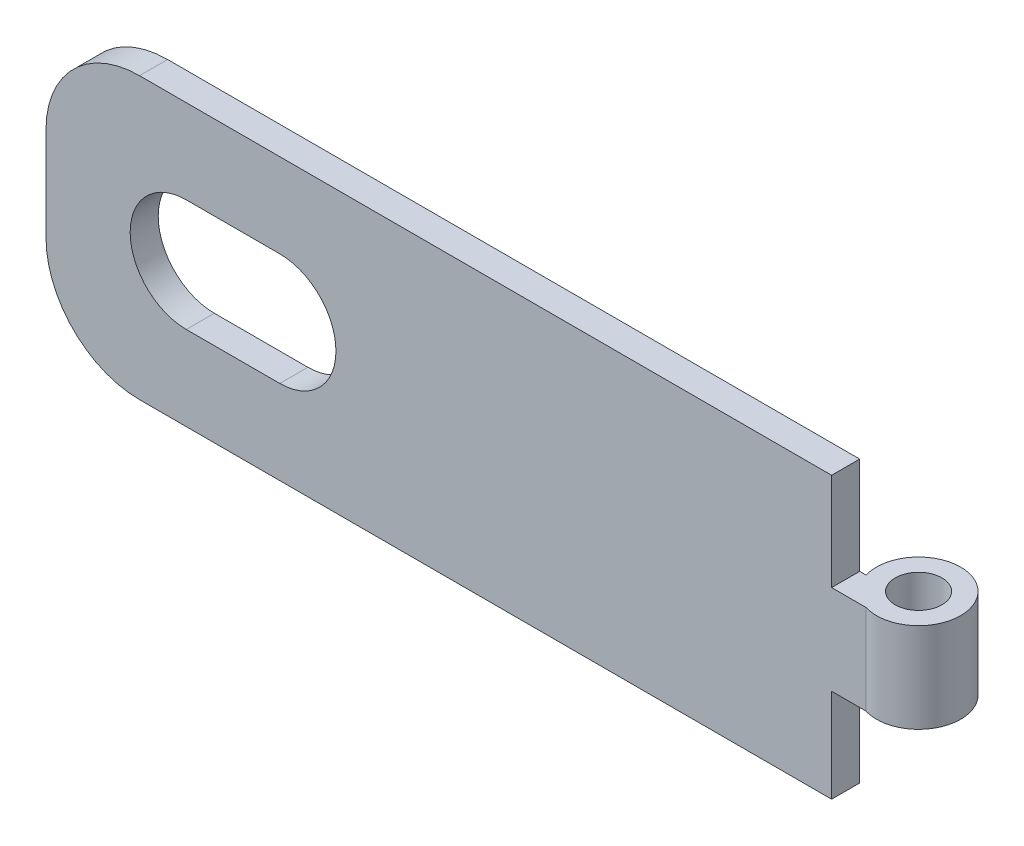
ISO-10303-21;
HEADER;
FILE_DESCRIPTION(('STEP AP214'),'2;1');
FILE_NAME('part.step','',(''),(''),'','','');
FILE_SCHEMA(('AUTOMOTIVE_DESIGN { 1 0 10303 214 1 1 1 1 }'));
ENDSEC;
DATA;
#1=APPLICATION_CONTEXT('core data for automotive mechanical design processes');
#2=APPLICATION_PROTOCOL_DEFINITION('international standard','automotive_design',2000,#1);
#3=PRODUCT_CONTEXT('',#1,'mechanical');
#4=PRODUCT('Part','Part','',(#3));
#5=PRODUCT_RELATED_PRODUCT_CATEGORY('part','',(#4));
#6=PRODUCT_DEFINITION_FORMATION('','',#4);
#7=PRODUCT_DEFINITION_CONTEXT('part definition',#1,'design');
#8=PRODUCT_DEFINITION('design','',#6,#7);
#9=PRODUCT_DEFINITION_SHAPE('','',#8);
#10=(LENGTH_UNIT() NAMED_UNIT(*) SI_UNIT(.MILLI.,.METRE.));
#11=(NAMED_UNIT(*) PLANE_ANGLE_UNIT() SI_UNIT($,.RADIAN.));
#12=(NAMED_UNIT(*) SI_UNIT($,.STERADIAN.) SOLID_ANGLE_UNIT());
#13=UNCERTAINTY_MEASURE_WITH_UNIT(LENGTH_MEASURE(1.E-05),#10,'distance_accuracy_value','');
#14=(GEOMETRIC_REPRESENTATION_CONTEXT(3) GLOBAL_UNCERTAINTY_ASSIGNED_CONTEXT((#13)) GLOBAL_UNIT_ASSIGNED_CONTEXT((#10,
#11,#12)) REPRESENTATION_CONTEXT('',''));
#15=CARTESIAN_POINT('',(0.,0.,0.));
#16=DIRECTION('',(0.,0.,1.));
#17=DIRECTION('',(1.,0.,0.));
#18=AXIS2_PLACEMENT_3D('',#15,#16,#17);
#19=CARTESIAN_POINT('',(0.,30.,3.));
#20=DIRECTION('',(-1.,0.,0.));
#21=DIRECTION('',(0.,0.,1.));
#22=AXIS2_PLACEMENT_3D('',#19,#20,#21);
#23=PLANE('',#22);
#24=DIRECTION('',(0.,-1.,0.));
#25=VECTOR('',#24,1.);
#26=CARTESIAN_POINT('',(0.,30.,3.));
#27=LINE('',#26,#25);
#28=CARTESIAN_POINT('',(0.,20.,3.));
#29=VERTEX_POINT('',#28);
#30=CARTESIAN_POINT('',(0.,10.,3.));
#31=VERTEX_POINT('',#30);
#32=EDGE_CURVE('E146',#29,#31,#27,.T.);
#33=ORIENTED_EDGE('',*,*,#32,.F.);
#34=DIRECTION('',(0.,0.,1.));
#35=VECTOR('',#34,1.);
#36=CARTESIAN_POINT('',(0.,20.,-5.80000000000001));
#37=LINE('',#36,#35);
#38=CARTESIAN_POINT('',(0.,20.,0.));
#39=VERTEX_POINT('',#38);
#40=EDGE_CURVE('E133',#39,#29,#37,.T.);
#41=ORIENTED_EDGE('',*,*,#40,.F.);
#42=DIRECTION('',(0.,-1.,0.));
#43=VECTOR('',#42,1.);
#44=CARTESIAN_POINT('',(0.,30.,0.));
#45=LINE('',#44,#43);
#46=CARTESIAN_POINT('',(0.,10.,0.));
#47=VERTEX_POINT('',#46);
#48=EDGE_CURVE('E152',#39,#47,#45,.T.);
#49=ORIENTED_EDGE('',*,*,#48,.T.);
#50=DIRECTION('',(0.,0.,1.));
#51=VECTOR('',#50,1.);
#52=CARTESIAN_POINT('',(0.,10.,-5.80000000000001));
#53=LINE('',#52,#51);
#54=EDGE_CURVE('E149',#47,#31,#53,.T.);
#55=ORIENTED_EDGE('',*,*,#54,.T.);
#56=EDGE_LOOP('',(#33,#41,#49,#55));
#57=FACE_BOUND('',#56,.T.);
#58=ADVANCED_FACE('F35',(#57),#23,.T.);
#59=CARTESIAN_POINT('',(0.,30.,0.));
#60=DIRECTION('',(0.,-1.,0.));
#61=DIRECTION('',(-1.,0.,0.));
#62=AXIS2_PLACEMENT_3D('',#59,#60,#61);
#63=PLANE('',#62);
#64=DIRECTION('',(0.,0.,1.));
#65=VECTOR('',#64,1.);
#66=CARTESIAN_POINT('',(10.,30.,-5.80000000000001));
#67=LINE('',#66,#65);
#68=CARTESIAN_POINT('',(10.,30.,3.));
#69=VERTEX_POINT('',#68);
#70=CARTESIAN_POINT('',(10.,30.,0.));
#71=VERTEX_POINT('',#70);
#72=EDGE_CURVE('E11',#69,#71,#67,.F.);
#73=ORIENTED_EDGE('',*,*,#72,.F.);
#74=DIRECTION('',(1.,0.,0.));
#75=VECTOR('',#74,1.);
#76=CARTESIAN_POINT('',(0.,30.,3.));
#77=LINE('',#76,#75);
#78=CARTESIAN_POINT('',(84.,30.,3.));
#79=VERTEX_POINT('',#78);
#80=EDGE_CURVE('E148',#69,#79,#77,.T.);
#81=ORIENTED_EDGE('',*,*,#80,.T.);
#82=DIRECTION('',(0.,0.,1.));
#83=VECTOR('',#82,1.);
#84=CARTESIAN_POINT('',(84.,30.,-5.80000000000001));
#85=LINE('',#84,#83);
#86=CARTESIAN_POINT('',(84.,30.,0.));
#87=VERTEX_POINT('',#86);
#88=EDGE_CURVE('E214',#87,#79,#85,.T.);
#89=ORIENTED_EDGE('',*,*,#88,.F.);
#90=DIRECTION('',(1.,0.,0.));
#91=VECTOR('',#90,1.);
#92=CARTESIAN_POINT('',(0.,30.,0.));
#93=LINE('',#92,#91);
#94=EDGE_CURVE('E153',#71,#87,#93,.T.);
#95=ORIENTED_EDGE('',*,*,#94,.F.);
#96=EDGE_LOOP('',(#73,#81,#89,#95));
#97=FACE_BOUND('',#96,.T.);
#98=ADVANCED_FACE('F271',(#97),#63,.F.);
#99=CARTESIAN_POINT('',(0.,0.,0.));
#100=DIRECTION('',(0.,-1.,0.));
#101=DIRECTION('',(-1.,0.,0.));
#102=AXIS2_PLACEMENT_3D('',#99,#100,#101);
#103=PLANE('',#102);
#104=DIRECTION('',(1.,0.,0.));
#105=VECTOR('',#104,1.);
#106=CARTESIAN_POINT('',(0.,0.,3.));
#107=LINE('',#106,#105);
#108=CARTESIAN_POINT('',(10.,0.,3.));
#109=VERTEX_POINT('',#108);
#110=CARTESIAN_POINT('',(84.,0.,3.));
#111=VERTEX_POINT('',#110);
#112=EDGE_CURVE('E185',#109,#111,#107,.T.);
#113=ORIENTED_EDGE('',*,*,#112,.F.);
#114=DIRECTION('',(0.,0.,1.));
#115=VECTOR('',#114,1.);
#116=CARTESIAN_POINT('',(10.,0.,-5.80000000000001));
#117=LINE('',#116,#115);
#118=CARTESIAN_POINT('',(10.,0.,0.));
#119=VERTEX_POINT('',#118);
#120=EDGE_CURVE('E43',#109,#119,#117,.F.);
#121=ORIENTED_EDGE('',*,*,#120,.T.);
#122=DIRECTION('',(1.,0.,0.));
#123=VECTOR('',#122,1.);
#124=CARTESIAN_POINT('',(0.,0.,0.));
#125=LINE('',#124,#123);
#126=CARTESIAN_POINT('',(84.,0.,0.));
#127=VERTEX_POINT('',#126);
#128=EDGE_CURVE('E159',#119,#127,#125,.T.);
#129=ORIENTED_EDGE('',*,*,#128,.T.);
#130=DIRECTION('',(0.,0.,1.));
#131=VECTOR('',#130,1.);
#132=CARTESIAN_POINT('',(84.,0.,-5.80000000000001));
#133=LINE('',#132,#131);
#134=EDGE_CURVE('E229',#127,#111,#133,.T.);
#135=ORIENTED_EDGE('',*,*,#134,.T.);
#136=EDGE_LOOP('',(#113,#121,#129,#135));
#137=FACE_BOUND('',#136,.T.);
#138=ADVANCED_FACE('F182',(#137),#103,.T.);
#139=CARTESIAN_POINT('',(0.,30.,3.));
#140=DIRECTION('',(0.,0.,-1.));
#141=DIRECTION('',(-1.,0.,0.));
#142=AXIS2_PLACEMENT_3D('',#139,#140,#141);
#143=PLANE('',#142);
#144=DIRECTION('',(1.,0.,0.));
#145=VECTOR('',#144,1.);
#146=CARTESIAN_POINT('',(15.,9.,3.));
#147=LINE('',#146,#145);
#148=CARTESIAN_POINT('',(15.,9.,3.));
#149=VERTEX_POINT('',#148);
#150=CARTESIAN_POINT('',(25.,9.,3.));
#151=VERTEX_POINT('',#150);
#152=EDGE_CURVE('E248',#149,#151,#147,.T.);
#153=ORIENTED_EDGE('',*,*,#152,.F.);
#154=CARTESIAN_POINT('',(15.,15.,3.));
#155=DIRECTION('',(0.,0.,1.));
#156=DIRECTION('',(1.,0.,0.));
#157=AXIS2_PLACEMENT_3D('',#154,#155,#156);
#158=CIRCLE('',#157,6.);
#159=CARTESIAN_POINT('',(15.,21.,3.));
#160=VERTEX_POINT('',#159);
#161=EDGE_CURVE('E251',#160,#149,#158,.T.);
#162=ORIENTED_EDGE('',*,*,#161,.F.);
#163=DIRECTION('',(-1.,0.,0.));
#164=VECTOR('',#163,1.);
#165=CARTESIAN_POINT('',(15.,21.,3.));
#166=LINE('',#165,#164);
#167=CARTESIAN_POINT('',(25.,21.,3.));
#168=VERTEX_POINT('',#167);
#169=EDGE_CURVE('E238',#168,#160,#166,.T.);
#170=ORIENTED_EDGE('',*,*,#169,.F.);
#171=CARTESIAN_POINT('',(25.,15.,3.));
#172=DIRECTION('',(0.,0.,1.));
#173=DIRECTION('',(-1.,0.,0.));
#174=AXIS2_PLACEMENT_3D('',#171,#172,#173);
#175=CIRCLE('',#174,6.);
#176=EDGE_CURVE('E245',#151,#168,#175,.T.);
#177=ORIENTED_EDGE('',*,*,#176,.F.);
#178=EDGE_LOOP('',(#153,#162,#170,#177));
#179=FACE_BOUND('',#178,.T.);
#180=ORIENTED_EDGE('',*,*,#80,.F.);
#181=CARTESIAN_POINT('',(10.,20.,3.));
#182=DIRECTION('',(0.,0.,-1.));
#183=DIRECTION('',(1.,0.,0.));
#184=AXIS2_PLACEMENT_3D('',#181,#182,#183);
#185=CIRCLE('',#184,10.);
#186=EDGE_CURVE('E49',#29,#69,#185,.T.);
#187=ORIENTED_EDGE('',*,*,#186,.F.);
#188=ORIENTED_EDGE('',*,*,#32,.T.);
#189=CARTESIAN_POINT('',(10.,10.,3.));
#190=DIRECTION('',(0.,0.,-1.));
#191=DIRECTION('',(1.,0.,0.));
#192=AXIS2_PLACEMENT_3D('',#189,#190,#191);
#193=CIRCLE('',#192,10.);
#194=EDGE_CURVE('E256',#109,#31,#193,.T.);
#195=ORIENTED_EDGE('',*,*,#194,.F.);
#196=ORIENTED_EDGE('',*,*,#112,.T.);
#197=DIRECTION('',(0.,1.,0.));
#198=VECTOR('',#197,1.);
#199=CARTESIAN_POINT('',(84.,30.,3.));
#200=LINE('',#199,#198);
#201=CARTESIAN_POINT('',(84.,10.,3.));
#202=VERTEX_POINT('',#201);
#203=EDGE_CURVE('E217',#111,#202,#200,.T.);
#204=ORIENTED_EDGE('',*,*,#203,.T.);
#205=DIRECTION('',(1.,0.,0.));
#206=VECTOR('',#205,1.);
#207=CARTESIAN_POINT('',(0.,10.,3.));
#208=LINE('',#207,#206);
#209=CARTESIAN_POINT('',(87.6733500838578,10.,3.));
#210=VERTEX_POINT('',#209);
#211=EDGE_CURVE('E225',#202,#210,#208,.T.);
#212=ORIENTED_EDGE('',*,*,#211,.T.);
#213=DIRECTION('',(0.,-1.,0.));
#214=VECTOR('',#213,1.);
#215=CARTESIAN_POINT('',(87.6733500838578,30.,3.));
#216=LINE('',#215,#214);
#217=CARTESIAN_POINT('',(87.6733500838578,19.6,3.));
#218=VERTEX_POINT('',#217);
#219=EDGE_CURVE('E193',#218,#210,#216,.T.);
#220=ORIENTED_EDGE('',*,*,#219,.F.);
#221=DIRECTION('',(-1.,0.,0.));
#222=VECTOR('',#221,1.);
#223=CARTESIAN_POINT('',(0.,19.6,3.));
#224=LINE('',#223,#222);
#225=CARTESIAN_POINT('',(84.,19.6,3.));
#226=VERTEX_POINT('',#225);
#227=EDGE_CURVE('E207',#218,#226,#224,.T.);
#228=ORIENTED_EDGE('',*,*,#227,.T.);
#229=DIRECTION('',(0.,1.,0.));
#230=VECTOR('',#229,1.);
#231=CARTESIAN_POINT('',(84.,30.,3.));
#232=LINE('',#231,#230);
#233=EDGE_CURVE('E202',#226,#79,#232,.T.);
#234=ORIENTED_EDGE('',*,*,#233,.T.);
#235=EDGE_LOOP('',(#180,#187,#188,#195,#196,#204,#212,#220,#228,#234));
#236=FACE_BOUND('',#235,.T.);
#237=ADVANCED_FACE('F37',(#179,#236),#143,.F.);
#238=CARTESIAN_POINT('',(0.,30.,0.));
#239=DIRECTION('',(0.,0.,-1.));
#240=DIRECTION('',(-1.,0.,0.));
#241=AXIS2_PLACEMENT_3D('',#238,#239,#240);
#242=PLANE('',#241);
#243=CARTESIAN_POINT('',(10.,20.,0.));
#244=DIRECTION('',(0.,0.,-1.));
#245=DIRECTION('',(-1.,0.,0.));
#246=AXIS2_PLACEMENT_3D('',#243,#244,#245);
#247=CIRCLE('',#246,10.);
#248=EDGE_CURVE('E136',#71,#39,#247,.F.);
#249=ORIENTED_EDGE('',*,*,#248,.F.);
#250=ORIENTED_EDGE('',*,*,#94,.T.);
#251=DIRECTION('',(0.,1.,0.));
#252=VECTOR('',#251,1.);
#253=CARTESIAN_POINT('',(84.,30.,0.));
#254=LINE('',#253,#252);
#255=CARTESIAN_POINT('',(84.,19.6,0.));
#256=VERTEX_POINT('',#255);
#257=EDGE_CURVE('E204',#256,#87,#254,.T.);
#258=ORIENTED_EDGE('',*,*,#257,.F.);
#259=DIRECTION('',(-1.,0.,0.));
#260=VECTOR('',#259,1.);
#261=CARTESIAN_POINT('',(0.,19.6,0.));
#262=LINE('',#261,#260);
#263=CARTESIAN_POINT('',(84.6918681542924,19.6,0.));
#264=VERTEX_POINT('',#263);
#265=EDGE_CURVE('E210',#264,#256,#262,.T.);
#266=ORIENTED_EDGE('',*,*,#265,.F.);
#267=DIRECTION('',(0.,-1.,0.));
#268=VECTOR('',#267,1.);
#269=CARTESIAN_POINT('',(84.6918681542924,30.,0.));
#270=LINE('',#269,#268);
#271=CARTESIAN_POINT('',(84.6918681542924,10.,0.));
#272=VERTEX_POINT('',#271);
#273=EDGE_CURVE('E197',#264,#272,#270,.T.);
#274=ORIENTED_EDGE('',*,*,#273,.T.);
#275=DIRECTION('',(1.,0.,0.));
#276=VECTOR('',#275,1.);
#277=CARTESIAN_POINT('',(0.,10.,0.));
#278=LINE('',#277,#276);
#279=CARTESIAN_POINT('',(84.,10.,0.));
#280=VERTEX_POINT('',#279);
#281=EDGE_CURVE('E222',#280,#272,#278,.T.);
#282=ORIENTED_EDGE('',*,*,#281,.F.);
#283=DIRECTION('',(0.,1.,0.));
#284=VECTOR('',#283,1.);
#285=CARTESIAN_POINT('',(84.,30.,0.));
#286=LINE('',#285,#284);
#287=EDGE_CURVE('E191',#127,#280,#286,.T.);
#288=ORIENTED_EDGE('',*,*,#287,.F.);
#289=ORIENTED_EDGE('',*,*,#128,.F.);
#290=CARTESIAN_POINT('',(10.,10.,0.));
#291=DIRECTION('',(0.,0.,-1.));
#292=DIRECTION('',(-1.,0.,0.));
#293=AXIS2_PLACEMENT_3D('',#290,#291,#292);
#294=CIRCLE('',#293,10.);
#295=EDGE_CURVE('E57',#47,#119,#294,.F.);
#296=ORIENTED_EDGE('',*,*,#295,.F.);
#297=ORIENTED_EDGE('',*,*,#48,.F.);
#298=EDGE_LOOP('',(#249,#250,#258,#266,#274,#282,#288,#289,#296,#297));
#299=FACE_BOUND('',#298,.T.);
#300=CARTESIAN_POINT('',(15.,15.,0.));
#301=DIRECTION('',(0.,0.,-1.));
#302=DIRECTION('',(-1.,0.,0.));
#303=AXIS2_PLACEMENT_3D('',#300,#301,#302);
#304=CIRCLE('',#303,6.);
#305=CARTESIAN_POINT('',(15.,9.,0.));
#306=VERTEX_POINT('',#305);
#307=CARTESIAN_POINT('',(15.,21.,0.));
#308=VERTEX_POINT('',#307);
#309=EDGE_CURVE('E178',#306,#308,#304,.T.);
#310=ORIENTED_EDGE('',*,*,#309,.F.);
#311=DIRECTION('',(-1.,0.,0.));
#312=VECTOR('',#311,1.);
#313=CARTESIAN_POINT('',(0.,9.,0.));
#314=LINE('',#313,#312);
#315=CARTESIAN_POINT('',(25.,9.,0.));
#316=VERTEX_POINT('',#315);
#317=EDGE_CURVE('E155',#316,#306,#314,.T.);
#318=ORIENTED_EDGE('',*,*,#317,.F.);
#319=CARTESIAN_POINT('',(25.,15.,0.));
#320=DIRECTION('',(0.,0.,-1.));
#321=DIRECTION('',(-1.,0.,0.));
#322=AXIS2_PLACEMENT_3D('',#319,#320,#321);
#323=CIRCLE('',#322,6.);
#324=CARTESIAN_POINT('',(25.,21.,0.));
#325=VERTEX_POINT('',#324);
#326=EDGE_CURVE('E173',#325,#316,#323,.T.);
#327=ORIENTED_EDGE('',*,*,#326,.F.);
#328=DIRECTION('',(1.,0.,0.));
#329=VECTOR('',#328,1.);
#330=CARTESIAN_POINT('',(0.,21.,0.));
#331=LINE('',#330,#329);
#332=EDGE_CURVE('E176',#308,#325,#331,.T.);
#333=ORIENTED_EDGE('',*,*,#332,.F.);
#334=EDGE_LOOP('',(#310,#318,#327,#333));
#335=FACE_BOUND('',#334,.T.);
#336=ADVANCED_FACE('F188',(#299,#335),#242,.T.);
#337=CARTESIAN_POINT('',(89.,30.,-1.3));
#338=DIRECTION('',(0.,-1.,0.));
#339=DIRECTION('',(0.,0.,-1.));
#340=AXIS2_PLACEMENT_3D('',#337,#338,#339);
#341=CYLINDRICAL_SURFACE('',#340,4.5);
#342=CARTESIAN_POINT('',(89.,10.,-1.3));
#343=DIRECTION('',(0.,1.,0.));
#344=DIRECTION('',(0.,0.,1.));
#345=AXIS2_PLACEMENT_3D('',#342,#343,#344);
#346=CIRCLE('',#345,4.5);
#347=EDGE_CURVE('E170',#210,#272,#346,.T.);
#348=ORIENTED_EDGE('',*,*,#347,.T.);
#349=ORIENTED_EDGE('',*,*,#273,.F.);
#350=CARTESIAN_POINT('',(89.,19.6,-1.3));
#351=DIRECTION('',(0.,-1.,0.));
#352=DIRECTION('',(1.,0.,0.));
#353=AXIS2_PLACEMENT_3D('',#350,#351,#352);
#354=CIRCLE('',#353,4.5);
#355=EDGE_CURVE('E165',#264,#218,#354,.T.);
#356=ORIENTED_EDGE('',*,*,#355,.T.);
#357=ORIENTED_EDGE('',*,*,#219,.T.);
#358=EDGE_LOOP('',(#348,#349,#356,#357));
#359=FACE_BOUND('',#358,.T.);
#360=ADVANCED_FACE('F281',(#359),#341,.T.);
#361=CARTESIAN_POINT('',(89.,30.,-1.3));
#362=DIRECTION('',(0.,-1.,0.));
#363=DIRECTION('',(0.,0.,-1.));
#364=AXIS2_PLACEMENT_3D('',#361,#362,#363);
#365=CYLINDRICAL_SURFACE('',#364,2.49999999999999);
#366=CARTESIAN_POINT('',(89.,10.,-1.3));
#367=DIRECTION('',(0.,1.,0.));
#368=DIRECTION('',(0.,0.,1.));
#369=AXIS2_PLACEMENT_3D('',#366,#367,#368);
#370=CIRCLE('',#369,2.49999999999999);
#371=CARTESIAN_POINT('',(89.,10.,1.19999999999999));
#372=VERTEX_POINT('',#371);
#373=EDGE_CURVE('E167',#372,#372,#370,.T.);
#374=ORIENTED_EDGE('',*,*,#373,.F.);
#375=EDGE_LOOP('',(#374));
#376=FACE_BOUND('',#375,.T.);
#377=CARTESIAN_POINT('',(89.,19.6,-1.3));
#378=DIRECTION('',(0.,-1.,0.));
#379=DIRECTION('',(1.,0.,0.));
#380=AXIS2_PLACEMENT_3D('',#377,#378,#379);
#381=CIRCLE('',#380,2.49999999999999);
#382=CARTESIAN_POINT('',(91.5,19.6,-1.3));
#383=VERTEX_POINT('',#382);
#384=EDGE_CURVE('E162',#383,#383,#381,.T.);
#385=ORIENTED_EDGE('',*,*,#384,.F.);
#386=EDGE_LOOP('',(#385));
#387=FACE_BOUND('',#386,.T.);
#388=ADVANCED_FACE('F287',(#376,#387),#365,.F.);
#389=CARTESIAN_POINT('',(84.,30.,-5.80000000000001));
#390=DIRECTION('',(-1.,0.,0.));
#391=DIRECTION('',(0.,0.,1.));
#392=AXIS2_PLACEMENT_3D('',#389,#390,#391);
#393=PLANE('',#392);
#394=DIRECTION('',(0.,0.,1.));
#395=VECTOR('',#394,1.);
#396=CARTESIAN_POINT('',(84.,19.6,-5.80000000000001));
#397=LINE('',#396,#395);
#398=EDGE_CURVE('E166',#256,#226,#397,.T.);
#399=ORIENTED_EDGE('',*,*,#398,.F.);
#400=ORIENTED_EDGE('',*,*,#257,.T.);
#401=ORIENTED_EDGE('',*,*,#88,.T.);
#402=ORIENTED_EDGE('',*,*,#233,.F.);
#403=EDGE_LOOP('',(#399,#400,#401,#402));
#404=FACE_BOUND('',#403,.T.);
#405=ADVANCED_FACE('F329',(#404),#393,.F.);
#406=CARTESIAN_POINT('',(95.,19.6,-5.80000000000001));
#407=DIRECTION('',(0.,-1.,0.));
#408=DIRECTION('',(1.,0.,0.));
#409=AXIS2_PLACEMENT_3D('',#406,#407,#408);
#410=PLANE('',#409);
#411=ORIENTED_EDGE('',*,*,#384,.T.);
#412=EDGE_LOOP('',(#411));
#413=FACE_BOUND('',#412,.T.);
#414=ORIENTED_EDGE('',*,*,#355,.F.);
#415=ORIENTED_EDGE('',*,*,#265,.T.);
#416=ORIENTED_EDGE('',*,*,#398,.T.);
#417=ORIENTED_EDGE('',*,*,#227,.F.);
#418=EDGE_LOOP('',(#414,#415,#416,#417));
#419=FACE_BOUND('',#418,.T.);
#420=ADVANCED_FACE('F325',(#413,#419),#410,.F.);
#421=CARTESIAN_POINT('',(84.,10.,-5.80000000000001));
#422=DIRECTION('',(-1.,0.,0.));
#423=DIRECTION('',(0.,0.,1.));
#424=AXIS2_PLACEMENT_3D('',#421,#422,#423);
#425=PLANE('',#424);
#426=ORIENTED_EDGE('',*,*,#134,.F.);
#427=ORIENTED_EDGE('',*,*,#287,.T.);
#428=DIRECTION('',(0.,0.,1.));
#429=VECTOR('',#428,1.);
#430=CARTESIAN_POINT('',(84.,10.,-5.80000000000001));
#431=LINE('',#430,#429);
#432=EDGE_CURVE('E171',#280,#202,#431,.T.);
#433=ORIENTED_EDGE('',*,*,#432,.T.);
#434=ORIENTED_EDGE('',*,*,#203,.F.);
#435=EDGE_LOOP('',(#426,#427,#433,#434));
#436=FACE_BOUND('',#435,.T.);
#437=ADVANCED_FACE('F321',(#436),#425,.F.);
#438=CARTESIAN_POINT('',(84.,10.,-5.80000000000001));
#439=DIRECTION('',(0.,1.,0.));
#440=DIRECTION('',(0.,0.,1.));
#441=AXIS2_PLACEMENT_3D('',#438,#439,#440);
#442=PLANE('',#441);
#443=ORIENTED_EDGE('',*,*,#281,.T.);
#444=ORIENTED_EDGE('',*,*,#347,.F.);
#445=ORIENTED_EDGE('',*,*,#211,.F.);
#446=ORIENTED_EDGE('',*,*,#432,.F.);
#447=EDGE_LOOP('',(#443,#444,#445,#446));
#448=FACE_BOUND('',#447,.T.);
#449=ORIENTED_EDGE('',*,*,#373,.T.);
#450=EDGE_LOOP('',(#449));
#451=FACE_BOUND('',#450,.T.);
#452=ADVANCED_FACE('F318',(#448,#451),#442,.F.);
#453=CARTESIAN_POINT('',(15.,15.,-5.80000000000001));
#454=DIRECTION('',(0.,0.,1.));
#455=DIRECTION('',(1.,0.,0.));
#456=AXIS2_PLACEMENT_3D('',#453,#454,#455);
#457=CYLINDRICAL_SURFACE('',#456,6.);
#458=ORIENTED_EDGE('',*,*,#309,.T.);
#459=DIRECTION('',(0.,0.,1.));
#460=VECTOR('',#459,1.);
#461=CARTESIAN_POINT('',(15.,21.,-5.80000000000001));
#462=LINE('',#461,#460);
#463=EDGE_CURVE('E231',#308,#160,#462,.T.);
#464=ORIENTED_EDGE('',*,*,#463,.T.);
#465=ORIENTED_EDGE('',*,*,#161,.T.);
#466=DIRECTION('',(0.,0.,1.));
#467=VECTOR('',#466,1.);
#468=CARTESIAN_POINT('',(15.,9.,-5.80000000000001));
#469=LINE('',#468,#467);
#470=EDGE_CURVE('E234',#306,#149,#469,.T.);
#471=ORIENTED_EDGE('',*,*,#470,.F.);
#472=EDGE_LOOP('',(#458,#464,#465,#471));
#473=FACE_BOUND('',#472,.T.);
#474=ADVANCED_FACE('F302',(#473),#457,.F.);
#475=CARTESIAN_POINT('',(15.,21.,-5.80000000000001));
#476=DIRECTION('',(0.,1.,0.));
#477=DIRECTION('',(0.,0.,1.));
#478=AXIS2_PLACEMENT_3D('',#475,#476,#477);
#479=PLANE('',#478);
#480=ORIENTED_EDGE('',*,*,#332,.T.);
#481=DIRECTION('',(0.,0.,1.));
#482=VECTOR('',#481,1.);
#483=CARTESIAN_POINT('',(25.,21.,-5.80000000000001));
#484=LINE('',#483,#482);
#485=EDGE_CURVE('E240',#325,#168,#484,.T.);
#486=ORIENTED_EDGE('',*,*,#485,.T.);
#487=ORIENTED_EDGE('',*,*,#169,.T.);
#488=ORIENTED_EDGE('',*,*,#463,.F.);
#489=EDGE_LOOP('',(#480,#486,#487,#488));
#490=FACE_BOUND('',#489,.T.);
#491=ADVANCED_FACE('F308',(#490),#479,.F.);
#492=CARTESIAN_POINT('',(25.,15.,-5.80000000000001));
#493=DIRECTION('',(0.,0.,1.));
#494=DIRECTION('',(1.,0.,0.));
#495=AXIS2_PLACEMENT_3D('',#492,#493,#494);
#496=CYLINDRICAL_SURFACE('',#495,6.);
#497=ORIENTED_EDGE('',*,*,#326,.T.);
#498=DIRECTION('',(0.,0.,1.));
#499=VECTOR('',#498,1.);
#500=CARTESIAN_POINT('',(25.,9.,-5.80000000000001));
#501=LINE('',#500,#499);
#502=EDGE_CURVE('E237',#316,#151,#501,.T.);
#503=ORIENTED_EDGE('',*,*,#502,.T.);
#504=ORIENTED_EDGE('',*,*,#176,.T.);
#505=ORIENTED_EDGE('',*,*,#485,.F.);
#506=EDGE_LOOP('',(#497,#503,#504,#505));
#507=FACE_BOUND('',#506,.T.);
#508=ADVANCED_FACE('F266',(#507),#496,.F.);
#509=CARTESIAN_POINT('',(15.,9.,-5.80000000000001));
#510=DIRECTION('',(0.,-1.,0.));
#511=DIRECTION('',(1.,0.,0.));
#512=AXIS2_PLACEMENT_3D('',#509,#510,#511);
#513=PLANE('',#512);
#514=ORIENTED_EDGE('',*,*,#317,.T.);
#515=ORIENTED_EDGE('',*,*,#470,.T.);
#516=ORIENTED_EDGE('',*,*,#152,.T.);
#517=ORIENTED_EDGE('',*,*,#502,.F.);
#518=EDGE_LOOP('',(#514,#515,#516,#517));
#519=FACE_BOUND('',#518,.T.);
#520=ADVANCED_FACE('F259',(#519),#513,.F.);
#521=CARTESIAN_POINT('',(10.,10.,-5.80000000000001));
#522=DIRECTION('',(0.,0.,1.));
#523=DIRECTION('',(1.,0.,0.));
#524=AXIS2_PLACEMENT_3D('',#521,#522,#523);
#525=CYLINDRICAL_SURFACE('',#524,10.);
#526=ORIENTED_EDGE('',*,*,#295,.T.);
#527=ORIENTED_EDGE('',*,*,#120,.F.);
#528=ORIENTED_EDGE('',*,*,#194,.T.);
#529=ORIENTED_EDGE('',*,*,#54,.F.);
#530=EDGE_LOOP('',(#526,#527,#528,#529));
#531=FACE_BOUND('',#530,.T.);
#532=ADVANCED_FACE('F257',(#531),#525,.T.);
#533=CARTESIAN_POINT('',(10.,20.,-5.80000000000001));
#534=DIRECTION('',(0.,0.,1.));
#535=DIRECTION('',(1.,0.,0.));
#536=AXIS2_PLACEMENT_3D('',#533,#534,#535);
#537=CYLINDRICAL_SURFACE('',#536,10.);
#538=ORIENTED_EDGE('',*,*,#248,.T.);
#539=ORIENTED_EDGE('',*,*,#40,.T.);
#540=ORIENTED_EDGE('',*,*,#186,.T.);
#541=ORIENTED_EDGE('',*,*,#72,.T.);
#542=EDGE_LOOP('',(#538,#539,#540,#541));
#543=FACE_BOUND('',#542,.T.);
#544=ADVANCED_FACE('F134',(#543),#537,.T.);
#545=CLOSED_SHELL('',(#58,#98,#138,#237,#336,#360,#388,#405,#420,#437,#452,#474,#491,#508,#520,
#532,#544));
#546=MANIFOLD_SOLID_BREP('B2',#545);
#547=ADVANCED_BREP_SHAPE_REPRESENTATION('',(#18,#546),#14);
#548=SHAPE_DEFINITION_REPRESENTATION(#9,#547);
ENDSEC;
END-ISO-10303-21;
